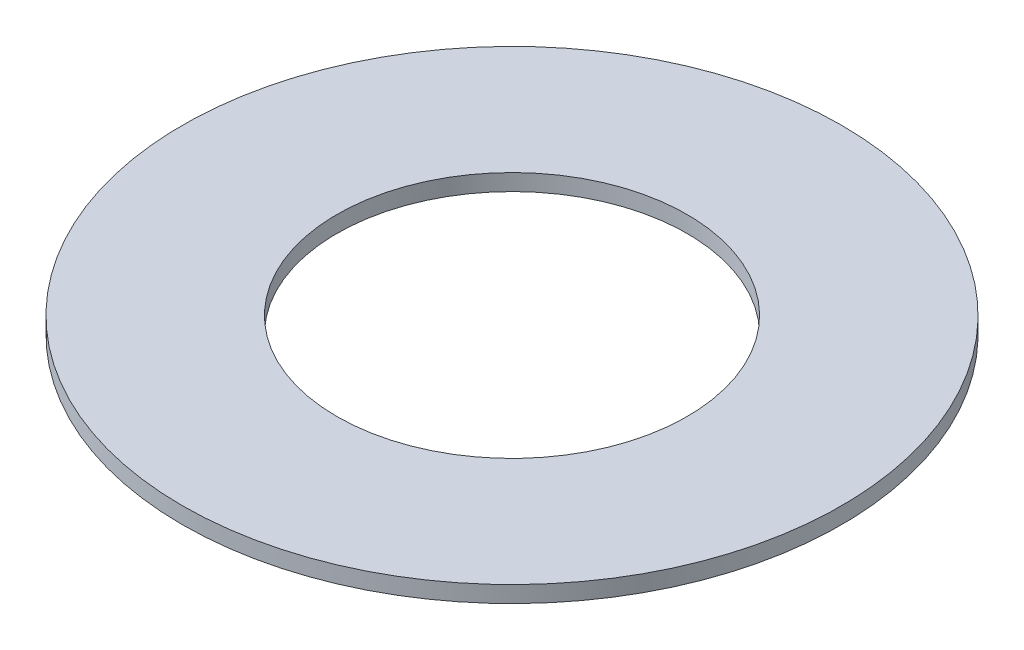
ISO-10303-21;
HEADER;
FILE_DESCRIPTION(('STEP AP214'),'2;1');
FILE_NAME('part.step','',(''),(''),'','','');
FILE_SCHEMA(('AUTOMOTIVE_DESIGN { 1 0 10303 214 1 1 1 1 }'));
ENDSEC;
DATA;
#1=APPLICATION_CONTEXT('core data for automotive mechanical design processes');
#2=APPLICATION_PROTOCOL_DEFINITION('international standard','automotive_design',2000,#1);
#3=PRODUCT_CONTEXT('',#1,'mechanical');
#4=PRODUCT('Part','Part','',(#3));
#5=PRODUCT_RELATED_PRODUCT_CATEGORY('part','',(#4));
#6=PRODUCT_DEFINITION_FORMATION('','',#4);
#7=PRODUCT_DEFINITION_CONTEXT('part definition',#1,'design');
#8=PRODUCT_DEFINITION('design','',#6,#7);
#9=PRODUCT_DEFINITION_SHAPE('','',#8);
#10=(LENGTH_UNIT() NAMED_UNIT(*) SI_UNIT(.MILLI.,.METRE.));
#11=(NAMED_UNIT(*) PLANE_ANGLE_UNIT() SI_UNIT($,.RADIAN.));
#12=(NAMED_UNIT(*) SI_UNIT($,.STERADIAN.) SOLID_ANGLE_UNIT());
#13=UNCERTAINTY_MEASURE_WITH_UNIT(LENGTH_MEASURE(1.E-05),#10,'distance_accuracy_value','');
#14=(GEOMETRIC_REPRESENTATION_CONTEXT(3) GLOBAL_UNCERTAINTY_ASSIGNED_CONTEXT((#13)) GLOBAL_UNIT_ASSIGNED_CONTEXT((#10,
#11,#12)) REPRESENTATION_CONTEXT('',''));
#15=CARTESIAN_POINT('',(0.,0.,0.));
#16=DIRECTION('',(0.,0.,1.));
#17=DIRECTION('',(1.,0.,0.));
#18=AXIS2_PLACEMENT_3D('',#15,#16,#17);
#19=CARTESIAN_POINT('',(0.,4.,0.));
#20=DIRECTION('',(0.,-1.,0.));
#21=DIRECTION('',(0.,0.,-1.));
#22=AXIS2_PLACEMENT_3D('',#19,#20,#21);
#23=CYLINDRICAL_SURFACE('',#22,80.);
#24=CARTESIAN_POINT('',(0.,4.,0.));
#25=DIRECTION('',(0.,1.,0.));
#26=DIRECTION('',(0.,0.,1.));
#27=AXIS2_PLACEMENT_3D('',#24,#25,#26);
#28=CIRCLE('',#27,80.);
#29=CARTESIAN_POINT('',(0.,4.,80.));
#30=VERTEX_POINT('',#29);
#31=EDGE_CURVE('E10',#30,#30,#28,.T.);
#32=ORIENTED_EDGE('',*,*,#31,.F.);
#33=EDGE_LOOP('',(#32));
#34=FACE_BOUND('',#33,.T.);
#35=CARTESIAN_POINT('',(0.,0.,0.));
#36=DIRECTION('',(0.,1.,0.));
#37=DIRECTION('',(0.,0.,1.));
#38=AXIS2_PLACEMENT_3D('',#35,#36,#37);
#39=CIRCLE('',#38,80.);
#40=CARTESIAN_POINT('',(0.,0.,80.));
#41=VERTEX_POINT('',#40);
#42=EDGE_CURVE('E37',#41,#41,#39,.T.);
#43=ORIENTED_EDGE('',*,*,#42,.T.);
#44=EDGE_LOOP('',(#43));
#45=FACE_BOUND('',#44,.T.);
#46=ADVANCED_FACE('F40',(#34,#45),#23,.T.);
#47=CARTESIAN_POINT('',(0.,4.,0.));
#48=DIRECTION('',(0.,1.,0.));
#49=DIRECTION('',(0.,0.,1.));
#50=AXIS2_PLACEMENT_3D('',#47,#48,#49);
#51=PLANE('',#50);
#52=CARTESIAN_POINT('',(0.,4.,0.));
#53=DIRECTION('',(0.,1.,0.));
#54=DIRECTION('',(0.,0.,1.));
#55=AXIS2_PLACEMENT_3D('',#52,#53,#54);
#56=CIRCLE('',#55,42.5);
#57=CARTESIAN_POINT('',(0.,4.,42.5));
#58=VERTEX_POINT('',#57);
#59=EDGE_CURVE('E50',#58,#58,#56,.T.);
#60=ORIENTED_EDGE('',*,*,#59,.F.);
#61=EDGE_LOOP('',(#60));
#62=FACE_BOUND('',#61,.T.);
#63=ORIENTED_EDGE('',*,*,#31,.T.);
#64=EDGE_LOOP('',(#63));
#65=FACE_BOUND('',#64,.T.);
#66=ADVANCED_FACE('F59',(#62,#65),#51,.T.);
#67=CARTESIAN_POINT('',(0.,0.,0.));
#68=DIRECTION('',(0.,1.,0.));
#69=DIRECTION('',(0.,0.,1.));
#70=AXIS2_PLACEMENT_3D('',#67,#68,#69);
#71=PLANE('',#70);
#72=CARTESIAN_POINT('',(0.,0.,0.));
#73=DIRECTION('',(0.,1.,0.));
#74=DIRECTION('',(0.,0.,1.));
#75=AXIS2_PLACEMENT_3D('',#72,#73,#74);
#76=CIRCLE('',#75,42.5);
#77=CARTESIAN_POINT('',(0.,0.,42.5));
#78=VERTEX_POINT('',#77);
#79=EDGE_CURVE('E47',#78,#78,#76,.T.);
#80=ORIENTED_EDGE('',*,*,#79,.T.);
#81=EDGE_LOOP('',(#80));
#82=FACE_BOUND('',#81,.T.);
#83=ORIENTED_EDGE('',*,*,#42,.F.);
#84=EDGE_LOOP('',(#83));
#85=FACE_BOUND('',#84,.T.);
#86=ADVANCED_FACE('F58',(#82,#85),#71,.F.);
#87=CARTESIAN_POINT('',(0.,4.,0.));
#88=DIRECTION('',(0.,-1.,0.));
#89=DIRECTION('',(0.,0.,-1.));
#90=AXIS2_PLACEMENT_3D('',#87,#88,#89);
#91=CYLINDRICAL_SURFACE('',#90,42.5);
#92=ORIENTED_EDGE('',*,*,#59,.T.);
#93=EDGE_LOOP('',(#92));
#94=FACE_BOUND('',#93,.T.);
#95=ORIENTED_EDGE('',*,*,#79,.F.);
#96=EDGE_LOOP('',(#95));
#97=FACE_BOUND('',#96,.T.);
#98=ADVANCED_FACE('F54',(#94,#97),#91,.F.);
#99=CLOSED_SHELL('',(#46,#66,#86,#98));
#100=MANIFOLD_SOLID_BREP('B2',#99);
#101=ADVANCED_BREP_SHAPE_REPRESENTATION('',(#18,#100),#14);
#102=SHAPE_DEFINITION_REPRESENTATION(#9,#101);
ENDSEC;
END-ISO-10303-21;
